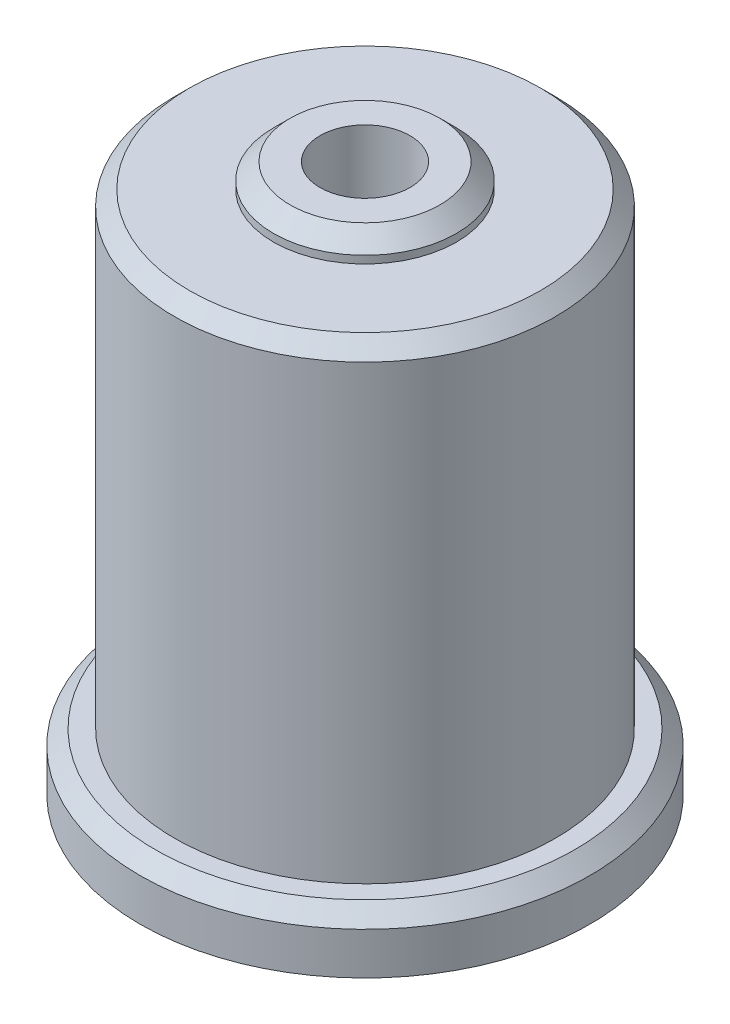
ISO-10303-21;
HEADER;
FILE_DESCRIPTION(('STEP AP214'),'2;1');
FILE_NAME('part.step','',(''),(''),'','','');
FILE_SCHEMA(('AUTOMOTIVE_DESIGN { 1 0 10303 214 1 1 1 1 }'));
ENDSEC;
DATA;
#1=APPLICATION_CONTEXT('core data for automotive mechanical design processes');
#2=APPLICATION_PROTOCOL_DEFINITION('international standard','automotive_design',2000,#1);
#3=PRODUCT_CONTEXT('',#1,'mechanical');
#4=PRODUCT('Part','Part','',(#3));
#5=PRODUCT_RELATED_PRODUCT_CATEGORY('part','',(#4));
#6=PRODUCT_DEFINITION_FORMATION('','',#4);
#7=PRODUCT_DEFINITION_CONTEXT('part definition',#1,'design');
#8=PRODUCT_DEFINITION('design','',#6,#7);
#9=PRODUCT_DEFINITION_SHAPE('','',#8);
#10=(LENGTH_UNIT() NAMED_UNIT(*) SI_UNIT(.MILLI.,.METRE.));
#11=(NAMED_UNIT(*) PLANE_ANGLE_UNIT() SI_UNIT($,.RADIAN.));
#12=(NAMED_UNIT(*) SI_UNIT($,.STERADIAN.) SOLID_ANGLE_UNIT());
#13=UNCERTAINTY_MEASURE_WITH_UNIT(LENGTH_MEASURE(1.E-05),#10,'distance_accuracy_value','');
#14=(GEOMETRIC_REPRESENTATION_CONTEXT(3) GLOBAL_UNCERTAINTY_ASSIGNED_CONTEXT((#13)) GLOBAL_UNIT_ASSIGNED_CONTEXT((#10,
#11,#12)) REPRESENTATION_CONTEXT('',''));
#15=CARTESIAN_POINT('',(0.,0.,0.));
#16=DIRECTION('',(0.,0.,1.));
#17=DIRECTION('',(1.,0.,0.));
#18=AXIS2_PLACEMENT_3D('',#15,#16,#17);
#19=CARTESIAN_POINT('',(0.,5.6843418860808E-11,0.));
#20=DIRECTION('',(0.,-1.,0.));
#21=DIRECTION('',(0.,0.,-1.));
#22=AXIS2_PLACEMENT_3D('',#19,#20,#21);
#23=CONICAL_SURFACE('',#22,3.15000000000509,0.785398163417049);
#24=CARTESIAN_POINT('',(0.,1.45,0.));
#25=DIRECTION('',(0.,-1.,0.));
#26=DIRECTION('',(0.,0.,-1.));
#27=AXIS2_PLACEMENT_3D('',#24,#25,#26);
#28=CIRCLE('',#27,1.7);
#29=CARTESIAN_POINT('',(0.,1.45,-1.7));
#30=VERTEX_POINT('',#29);
#31=EDGE_CURVE('E93',#30,#30,#28,.F.);
#32=ORIENTED_EDGE('',*,*,#31,.T.);
#33=EDGE_LOOP('',(#32));
#34=FACE_BOUND('',#33,.T.);
#35=CARTESIAN_POINT('',(0.,5.6843418860808E-11,0.));
#36=DIRECTION('',(0.,-1.,0.));
#37=DIRECTION('',(0.,0.,-1.));
#38=AXIS2_PLACEMENT_3D('',#35,#36,#37);
#39=CIRCLE('',#38,3.15000000000509);
#40=CARTESIAN_POINT('',(0.,5.6843418860808E-11,-3.15000000000509));
#41=VERTEX_POINT('',#40);
#42=EDGE_CURVE('E27',#41,#41,#39,.T.);
#43=ORIENTED_EDGE('',*,*,#42,.T.);
#44=EDGE_LOOP('',(#43));
#45=FACE_BOUND('',#44,.T.);
#46=ADVANCED_FACE('F24',(#34,#45),#23,.F.);
#47=CARTESIAN_POINT('',(0.,35.4250000004299,0.));
#48=DIRECTION('',(0.,-1.,0.));
#49=DIRECTION('',(0.,0.,-1.));
#50=AXIS2_PLACEMENT_3D('',#47,#48,#49);
#51=CONICAL_SURFACE('',#50,6.09999999949196,0.785398163397448);
#52=CARTESIAN_POINT('',(0.,36.5249999999264,0.));
#53=DIRECTION('',(0.,-1.,0.));
#54=DIRECTION('',(0.,0.,-1.));
#55=AXIS2_PLACEMENT_3D('',#52,#53,#54);
#56=CIRCLE('',#55,4.99999999999545);
#57=CARTESIAN_POINT('',(0.,36.5249999999264,-4.99999999999545));
#58=VERTEX_POINT('',#57);
#59=EDGE_CURVE('E62',#58,#58,#56,.F.);
#60=ORIENTED_EDGE('',*,*,#59,.F.);
#61=EDGE_LOOP('',(#60));
#62=FACE_BOUND('',#61,.T.);
#63=CARTESIAN_POINT('',(0.,35.4250000007,0.));
#64=DIRECTION('',(0.,-1.,0.));
#65=DIRECTION('',(0.,0.,-1.));
#66=AXIS2_PLACEMENT_3D('',#63,#64,#65);
#67=CIRCLE('',#66,6.1);
#68=CARTESIAN_POINT('',(0.,35.4250000007,-6.1));
#69=VERTEX_POINT('',#68);
#70=EDGE_CURVE('E63',#69,#69,#67,.T.);
#71=ORIENTED_EDGE('',*,*,#70,.F.);
#72=EDGE_LOOP('',(#71));
#73=FACE_BOUND('',#72,.T.);
#74=ADVANCED_FACE('F184',(#62,#73),#51,.T.);
#75=CARTESIAN_POINT('',(0.,0.,0.));
#76=DIRECTION('',(0.,-1.,0.));
#77=DIRECTION('',(0.,0.,-1.));
#78=AXIS2_PLACEMENT_3D('',#75,#76,#77);
#79=CYLINDRICAL_SURFACE('',#78,1.7);
#80=ORIENTED_EDGE('',*,*,#31,.F.);
#81=EDGE_LOOP('',(#80));
#82=FACE_BOUND('',#81,.T.);
#83=CARTESIAN_POINT('',(0.,1.7188811952451,0.));
#84=DIRECTION('',(0.,1.,0.));
#85=DIRECTION('',(0.,0.,1.));
#86=AXIS2_PLACEMENT_3D('',#83,#84,#85);
#87=CIRCLE('',#86,1.69999999997117);
#88=CARTESIAN_POINT('',(0.,1.71888119525931,-1.7000000000068));
#89=VERTEX_POINT('',#88);
#90=CARTESIAN_POINT('',(0.,1.71888119526405,1.7000000000068));
#91=VERTEX_POINT('',#90);
#92=EDGE_CURVE('E59',#89,#91,#87,.T.);
#93=ORIENTED_EDGE('',*,*,#92,.T.);
#94=CARTESIAN_POINT('',(0.,1.71888119530195,0.));
#95=DIRECTION('',(0.,1.,0.));
#96=DIRECTION('',(0.,0.,1.));
#97=AXIS2_PLACEMENT_3D('',#94,#95,#96);
#98=CIRCLE('',#97,1.70000000008486);
#99=EDGE_CURVE('E54',#91,#89,#98,.T.);
#100=ORIENTED_EDGE('',*,*,#99,.T.);
#101=EDGE_LOOP('',(#93,#100));
#102=FACE_BOUND('',#101,.T.);
#103=ADVANCED_FACE('F57',(#82,#102),#79,.F.);
#104=CARTESIAN_POINT('',(0.,0.,0.));
#105=DIRECTION('',(0.,1.,0.));
#106=DIRECTION('',(0.,0.,1.));
#107=AXIS2_PLACEMENT_3D('',#104,#105,#106);
#108=PLANE('',#107);
#109=ORIENTED_EDGE('',*,*,#42,.F.);
#110=EDGE_LOOP('',(#109));
#111=FACE_BOUND('',#110,.T.);
#112=CARTESIAN_POINT('',(0.,-5.21541143605475E-10,0.));
#113=DIRECTION('',(0.,-1.,0.));
#114=DIRECTION('',(0.,0.,-1.));
#115=AXIS2_PLACEMENT_3D('',#112,#113,#114);
#116=CIRCLE('',#115,15.);
#117=CARTESIAN_POINT('',(0.,-5.21541143605475E-10,-15.));
#118=VERTEX_POINT('',#117);
#119=EDGE_CURVE('E75',#118,#118,#116,.F.);
#120=ORIENTED_EDGE('',*,*,#119,.F.);
#121=EDGE_LOOP('',(#120));
#122=FACE_BOUND('',#121,.T.);
#123=ADVANCED_FACE('F178',(#111,#122),#108,.F.);
#124=CARTESIAN_POINT('',(0.,0.,0.));
#125=DIRECTION('',(0.,-1.,0.));
#126=DIRECTION('',(0.,0.,-1.));
#127=AXIS2_PLACEMENT_3D('',#124,#125,#126);
#128=CYLINDRICAL_SURFACE('',#127,6.1);
#129=CARTESIAN_POINT('',(0.,34.9250000007,0.));
#130=DIRECTION('',(0.,-1.,0.));
#131=DIRECTION('',(0.,0.,-1.));
#132=AXIS2_PLACEMENT_3D('',#129,#130,#131);
#133=CIRCLE('',#132,6.1);
#134=CARTESIAN_POINT('',(0.,34.9250000007,-6.1));
#135=VERTEX_POINT('',#134);
#136=EDGE_CURVE('E83',#135,#135,#133,.T.);
#137=ORIENTED_EDGE('',*,*,#136,.F.);
#138=EDGE_LOOP('',(#137));
#139=FACE_BOUND('',#138,.T.);
#140=ORIENTED_EDGE('',*,*,#70,.T.);
#141=EDGE_LOOP('',(#140));
#142=FACE_BOUND('',#141,.T.);
#143=ADVANCED_FACE('F175',(#139,#142),#128,.T.);
#144=CARTESIAN_POINT('',(0.,2.49999999994088,0.));
#145=DIRECTION('',(0.,1.,0.));
#146=DIRECTION('',(0.,0.,1.));
#147=AXIS2_PLACEMENT_3D('',#144,#145,#146);
#148=CONICAL_SURFACE('',#147,2.99999999987222,1.0297442586592);
#149=ORIENTED_EDGE('',*,*,#99,.F.);
#150=DIRECTION('',(0.,-0.515038074907186,-0.857167300703835));
#151=VECTOR('',#150,1.);
#152=CARTESIAN_POINT('',(0.,299830.146310623,499000.));
#153=LINE('',#152,#151);
#154=CARTESIAN_POINT('',(0.,2.49999999984619,2.99999999996805));
#155=VERTEX_POINT('',#154);
#156=EDGE_CURVE('E71',#91,#155,#153,.F.);
#157=ORIENTED_EDGE('',*,*,#156,.T.);
#158=CARTESIAN_POINT('',(0.,2.5,0.));
#159=DIRECTION('',(0.,1.,0.));
#160=DIRECTION('',(0.,0.,1.));
#161=AXIS2_PLACEMENT_3D('',#158,#159,#160);
#162=CIRCLE('',#161,3.);
#163=CARTESIAN_POINT('',(0.,2.49999999980022,-2.99999999996805));
#164=VERTEX_POINT('',#163);
#165=EDGE_CURVE('E46',#155,#164,#162,.T.);
#166=ORIENTED_EDGE('',*,*,#165,.T.);
#167=DIRECTION('',(0.,-0.515038074907186,0.857167300703835));
#168=VECTOR('',#167,1.);
#169=CARTESIAN_POINT('',(6.11098752774529E-11,299830.146310623,-499000.));
#170=LINE('',#169,#168);
#171=EDGE_CURVE('E65',#164,#89,#170,.T.);
#172=ORIENTED_EDGE('',*,*,#171,.T.);
#173=EDGE_LOOP('',(#149,#157,#166,#172));
#174=FACE_BOUND('',#173,.T.);
#175=ADVANCED_FACE('F66',(#174),#148,.F.);
#176=CARTESIAN_POINT('',(0.,36.525,-5.));
#177=DIRECTION('',(0.,1.,0.));
#178=DIRECTION('',(0.,0.,1.));
#179=AXIS2_PLACEMENT_3D('',#176,#177,#178);
#180=PLANE('',#179);
#181=CARTESIAN_POINT('',(0.,36.525,0.));
#182=DIRECTION('',(0.,1.,0.));
#183=DIRECTION('',(0.,0.,1.));
#184=AXIS2_PLACEMENT_3D('',#181,#182,#183);
#185=CIRCLE('',#184,3.);
#186=CARTESIAN_POINT('',(0.,36.525,3.));
#187=VERTEX_POINT('',#186);
#188=EDGE_CURVE('E205',#187,#187,#185,.F.);
#189=ORIENTED_EDGE('',*,*,#188,.T.);
#190=EDGE_LOOP('',(#189));
#191=FACE_BOUND('',#190,.T.);
#192=ORIENTED_EDGE('',*,*,#59,.T.);
#193=EDGE_LOOP('',(#192));
#194=FACE_BOUND('',#193,.T.);
#195=ADVANCED_FACE('F169',(#191,#194),#180,.T.);
#196=CARTESIAN_POINT('',(0.,2.49999999999773,0.));
#197=DIRECTION('',(0.,1.,0.));
#198=DIRECTION('',(0.,0.,1.));
#199=AXIS2_PLACEMENT_3D('',#196,#197,#198);
#200=CONICAL_SURFACE('',#199,2.9999999999859,1.02974425867217);
#201=ORIENTED_EDGE('',*,*,#171,.F.);
#202=CARTESIAN_POINT('',(0.,2.49999999963,0.));
#203=DIRECTION('',(0.,1.,0.));
#204=DIRECTION('',(0.,0.,1.));
#205=AXIS2_PLACEMENT_3D('',#202,#203,#204);
#206=CIRCLE('',#205,3.);
#207=EDGE_CURVE('E208',#164,#155,#206,.T.);
#208=ORIENTED_EDGE('',*,*,#207,.T.);
#209=ORIENTED_EDGE('',*,*,#156,.F.);
#210=ORIENTED_EDGE('',*,*,#92,.F.);
#211=EDGE_LOOP('',(#201,#208,#209,#210));
#212=FACE_BOUND('',#211,.T.);
#213=ADVANCED_FACE('F73',(#212),#200,.F.);
#214=CARTESIAN_POINT('',(0.,3.81,0.));
#215=DIRECTION('',(0.,-1.,0.));
#216=DIRECTION('',(0.,0.,-1.));
#217=AXIS2_PLACEMENT_3D('',#214,#215,#216);
#218=CYLINDRICAL_SURFACE('',#217,15.);
#219=ORIENTED_EDGE('',*,*,#119,.T.);
#220=EDGE_LOOP('',(#219));
#221=FACE_BOUND('',#220,.T.);
#222=CARTESIAN_POINT('',(0.,2.80999999999955,0.));
#223=DIRECTION('',(0.,-1.,0.));
#224=DIRECTION('',(0.,0.,-1.));
#225=AXIS2_PLACEMENT_3D('',#222,#223,#224);
#226=CIRCLE('',#225,14.9999999999996);
#227=CARTESIAN_POINT('',(0.,2.80999999999955,-14.9999999999996));
#228=VERTEX_POINT('',#227);
#229=EDGE_CURVE('E212',#228,#228,#226,.F.);
#230=ORIENTED_EDGE('',*,*,#229,.F.);
#231=EDGE_LOOP('',(#230));
#232=FACE_BOUND('',#231,.T.);
#233=ADVANCED_FACE('F162',(#221,#232),#218,.T.);
#234=CARTESIAN_POINT('',(0.,34.925,0.));
#235=DIRECTION('',(0.,1.,0.));
#236=DIRECTION('',(0.,0.,1.));
#237=AXIS2_PLACEMENT_3D('',#234,#235,#236);
#238=PLANE('',#237);
#239=ORIENTED_EDGE('',*,*,#136,.T.);
#240=EDGE_LOOP('',(#239));
#241=FACE_BOUND('',#240,.T.);
#242=CARTESIAN_POINT('',(0.,34.925,0.));
#243=DIRECTION('',(0.,-1.,0.));
#244=DIRECTION('',(0.,0.,-1.));
#245=AXIS2_PLACEMENT_3D('',#242,#243,#244);
#246=CIRCLE('',#245,11.7);
#247=CARTESIAN_POINT('',(0.,34.925,-11.7));
#248=VERTEX_POINT('',#247);
#249=EDGE_CURVE('E209',#248,#248,#246,.T.);
#250=ORIENTED_EDGE('',*,*,#249,.F.);
#251=EDGE_LOOP('',(#250));
#252=FACE_BOUND('',#251,.T.);
#253=ADVANCED_FACE('F156',(#241,#252),#238,.T.);
#254=CARTESIAN_POINT('',(0.,36.525,0.));
#255=DIRECTION('',(0.,1.,0.));
#256=DIRECTION('',(0.,0.,1.));
#257=AXIS2_PLACEMENT_3D('',#254,#255,#256);
#258=CYLINDRICAL_SURFACE('',#257,3.);
#259=ORIENTED_EDGE('',*,*,#188,.F.);
#260=EDGE_LOOP('',(#259));
#261=FACE_BOUND('',#260,.T.);
#262=CARTESIAN_POINT('',(1.64999999997305,28.,-2.50549396325899));
#263=CARTESIAN_POINT('',(1.64999840373645,27.9153708936246,-2.50549638400502));
#264=CARTESIAN_POINT('',(1.64345056127903,27.830729860844,-2.50984429312439));
#265=CARTESIAN_POINT('',(1.61766820329312,27.6641915008115,-2.52653380821258));
#266=CARTESIAN_POINT('',(1.5984215728503,27.5822968721654,-2.53888304741816));
#267=CARTESIAN_POINT('',(1.54839307975169,27.4239437560951,-2.56969382834051));
#268=CARTESIAN_POINT('',(1.51767952421363,27.3474562061838,-2.58811910143614));
#269=CARTESIAN_POINT('',(1.44580815787351,27.2007377586921,-2.62894336394147));
#270=CARTESIAN_POINT('',(1.40464700957062,27.1305088701559,-2.65134362247755));
#271=CARTESIAN_POINT('',(1.30819183349276,26.9905094475607,-2.70034130013384));
#272=CARTESIAN_POINT('',(1.25189044896349,26.9215011613221,-2.72713413750485));
#273=CARTESIAN_POINT('',(1.12882699874038,26.79328890541,-2.78033210845833));
#274=CARTESIAN_POINT('',(1.06205795707837,26.7340915285407,-2.80673697055438));
#275=CARTESIAN_POINT('',(0.912963549432726,26.6221708897394,-2.85889021724689));
#276=CARTESIAN_POINT('',(0.829793649593391,26.5704443324047,-2.88438619675471));
#277=CARTESIAN_POINT('',(0.654291228544041,26.482100467782,-2.92917486122191));
#278=CARTESIAN_POINT('',(0.561971033054588,26.445463168952,-2.94847574643836));
#279=CARTESIAN_POINT('',(0.391418922383002,26.3951864311231,-2.97532920501404));
#280=CARTESIAN_POINT('',(0.314389644420546,26.3783062858043,-2.98451058646589));
#281=CARTESIAN_POINT('',(0.15824316017263,26.3557148045967,-2.99684529996304));
#282=CARTESIAN_POINT('',(0.0791268427111652,26.3499987895632,-3.00000115743207));
#283=CARTESIAN_POINT('',(-0.0857394555554362,26.3500013115927,-2.99999874584159));
#284=CARTESIAN_POINT('',(-0.171491269053555,26.3567153517836,-2.99629076639798));
#285=CARTESIAN_POINT('',(-0.340348376484555,26.3832202031107,-2.98183771920608));
#286=CARTESIAN_POINT('',(-0.423452291679823,26.4030177137218,-2.9710890462504));
#287=CARTESIAN_POINT('',(-0.584397615441961,26.4546521590814,-2.94365850592254));
#288=CARTESIAN_POINT('',(-0.662257568957312,26.4864437222334,-2.92699901221874));
#289=CARTESIAN_POINT('',(-0.811396545708618,26.5608721508766,-2.88921483820871));
#290=CARTESIAN_POINT('',(-0.882674264516601,26.60351115979,-2.8680892755604));
#291=CARTESIAN_POINT('',(-1.02211397679699,26.7017135075675,-2.8215333458695));
#292=CARTESIAN_POINT('',(-1.08972586800159,26.7579633096431,-2.79590698364791));
#293=CARTESIAN_POINT('',(-1.2150825054972,26.8802876821038,-2.74375531569346));
#294=CARTESIAN_POINT('',(-1.27281736357077,26.9463719758152,-2.71722914058829));
#295=CARTESIAN_POINT('',(-1.38253830070289,27.0942501396172,-2.66320939989596));
#296=CARTESIAN_POINT('',(-1.43339190870582,27.1769511793746,-2.63587941810725));
#297=CARTESIAN_POINT('',(-1.52024089502079,27.3512970247828,-2.58676868519413));
#298=CARTESIAN_POINT('',(-1.55625793396413,27.4429285487803,-2.56497986218541));
#299=CARTESIAN_POINT('',(-1.60561843895256,27.6120858341263,-2.53429331170074));
#300=CARTESIAN_POINT('',(-1.62218822122814,27.6883498269149,-2.52362317859876));
#301=CARTESIAN_POINT('',(-1.64437513125999,27.8430737322073,-2.50922530445806));
#302=CARTESIAN_POINT('',(-1.65000148002315,27.9215317394188,-2.50549171875923));
#303=CARTESIAN_POINT('',(-1.64999840377452,28.0846291061707,-2.50549638401327));
#304=CARTESIAN_POINT('',(-1.64345056130775,28.1692701389479,-2.50984429311441));
#305=CARTESIAN_POINT('',(-1.61766820332933,28.3358084989774,-2.52653380818052));
#306=CARTESIAN_POINT('',(-1.59842157290324,28.4177031276239,-2.53888304738235));
#307=CARTESIAN_POINT('',(-1.54839307983107,28.5760562436965,-2.5696938282948));
#308=CARTESIAN_POINT('',(-1.51767952430278,28.6525437936098,-2.58811910138427));
#309=CARTESIAN_POINT('',(-1.44580815798417,28.7992622411064,-2.62894336387984));
#310=CARTESIAN_POINT('',(-1.40464700969308,28.8694911296457,-2.65134362241229));
#311=CARTESIAN_POINT('',(-1.30819183364077,29.0094905522472,-2.70034130006201));
#312=CARTESIAN_POINT('',(-1.25189044912548,29.0784988384894,-2.72713413743019));
#313=CARTESIAN_POINT('',(-1.12882699893082,29.2067110944113,-2.78033210838064));
#314=CARTESIAN_POINT('',(-1.06205795728323,29.2659084712869,-2.8067369704765));
#315=CARTESIAN_POINT('',(-0.91296354966216,29.3778291101085,-2.85889021717338));
#316=CARTESIAN_POINT('',(-0.829793649832179,29.4295556674566,-2.88438619668581));
#317=CARTESIAN_POINT('',(-0.654291228799361,29.5178995321079,-2.92917486116468));
#318=CARTESIAN_POINT('',(-0.56197103331708,29.5545368309531,-2.94847574638821));
#319=CARTESIAN_POINT('',(-0.391418922610912,29.6048135688235,-2.97532920498511));
#320=CARTESIAN_POINT('',(-0.31438964460507,29.6216937141622,-2.98451058644766));
#321=CARTESIAN_POINT('',(-0.158243160266696,29.6442851953965,-2.99684529995926));
#322=CARTESIAN_POINT('',(-0.0791268427581616,29.6500012104367,-3.00000115743206));
#323=CARTESIAN_POINT('',(0.0857394555555356,29.6499986884073,-2.9999987458416));
#324=CARTESIAN_POINT('',(0.171491269053654,29.6432846482164,-2.99629076639798));
#325=CARTESIAN_POINT('',(0.340348376484621,29.6167797968893,-2.98183771920607));
#326=CARTESIAN_POINT('',(0.423452291679859,29.5969822862782,-2.97108904625039));
#327=CARTESIAN_POINT('',(0.584397615442018,29.5453478409186,-2.94365850592253));
#328=CARTESIAN_POINT('',(0.662257568957415,29.5135562777665,-2.92699901221872));
#329=CARTESIAN_POINT('',(0.811396545708705,29.4391278491234,-2.88921483820868));
#330=CARTESIAN_POINT('',(0.882674264516634,29.3964888402099,-2.86808927556038));
#331=CARTESIAN_POINT('',(1.02211397679687,29.2982864924326,-2.82153334586955));
#332=CARTESIAN_POINT('',(1.08972586800139,29.2420366903571,-2.79590698364803));
#333=CARTESIAN_POINT('',(1.21508250549695,29.1197123178964,-2.74375531569353));
#334=CARTESIAN_POINT('',(1.2728173635705,29.0536280241849,-2.71722914058824));
#335=CARTESIAN_POINT('',(1.38253830070326,28.9057498603826,-2.66320939989597));
#336=CARTESIAN_POINT('',(1.43339190870686,28.8230488206249,-2.63587941810747));
#337=CARTESIAN_POINT('',(1.5202408950203,28.6487029752166,-2.5867686851936));
#338=CARTESIAN_POINT('',(1.55625793396153,28.5570714512194,-2.5649798621839));
#339=CARTESIAN_POINT('',(1.6056184389637,28.3879141658428,-2.53429331169626));
#340=CARTESIAN_POINT('',(1.62218822124904,28.3116501730215,-2.52362317859368));
#341=CARTESIAN_POINT('',(1.64437513126703,28.1569262676616,-2.50922530444502));
#342=CARTESIAN_POINT('',(1.65000148000652,28.0784682604151,-2.5054917187389));
#343=CARTESIAN_POINT('',(1.64999999997305,28.,-2.50549396325899));
#344=B_SPLINE_CURVE_WITH_KNOTS('',3,(#262,#263,#264,#265,#266,#267,#268,#269,#270,#271,#272,
#273,#274,#275,#276,#277,#278,#279,#280,#281,#282,#283,#284,#285,#286,#287,#288,#289,#290,#291,
#292,#293,#294,#295,#296,#297,#298,#299,#300,#301,#302,#303,#304,#305,#306,#307,#308,#309,#310,
#311,#312,#313,#314,#315,#316,#317,#318,#319,#320,#321,#322,#323,#324,#325,#326,#327,#328,#329,
#330,#331,#332,#333,#334,#335,#336,#337,#338,#339,#340,#341,#342,#343),.UNSPECIFIED.,.T.,.F.,(4,
2,2,2,2,2,2,2,2,2,2,2,2,2,2,2,2,2,2,2,2,2,2,2,2,2,2,2,2,2,2,2,2,2,2,2,2,2,2,2,4),(0.,
0.253564174119336,0.507370604324656,0.759688655532,1.01208741182752,1.2899706705777,
1.56803991271795,1.87005826832733,2.17167518686959,2.40886924606036,2.64596387039496,
2.90287244034478,3.15991266401271,3.41599013933279,3.67211825413985,3.94583529023378,
4.21982476976385,4.52089904055118,4.82153218701419,5.05683570180663,5.29194086231763,
5.54550503642476,5.79931146662029,6.05162951781719,6.30402827410063,6.58191153283098,
6.85998077495234,7.16199913056275,7.46361604910634,7.70081010843803,7.93790473291329,
8.19481330286323,8.45185352653104,8.70793100185129,8.96405911665818,9.23777615275161,
9.51176563228218,9.81283990307045,10.1134730495325,10.3487765644231,10.583881725034),.UNSPECIFIED.);
#345=CARTESIAN_POINT('',(1.64999999997305,28.,-2.50549396325899));
#346=VERTEX_POINT('',#345);
#347=EDGE_CURVE('E141',#346,#346,#344,.T.);
#348=ORIENTED_EDGE('',*,*,#347,.T.);
#349=EDGE_LOOP('',(#348));
#350=FACE_BOUND('',#349,.T.);
#351=CARTESIAN_POINT('',(1.64999999997305,12.,-2.50549396325899));
#352=CARTESIAN_POINT('',(1.64999840373645,11.9153708936246,-2.50549638400502));
#353=CARTESIAN_POINT('',(1.64345056127903,11.830729860844,-2.50984429312439));
#354=CARTESIAN_POINT('',(1.61766820329312,11.6641915008115,-2.52653380821258));
#355=CARTESIAN_POINT('',(1.5984215728503,11.5822968721653,-2.53888304741816));
#356=CARTESIAN_POINT('',(1.54839307975169,11.4239437560951,-2.56969382834051));
#357=CARTESIAN_POINT('',(1.51767952421363,11.3474562061838,-2.58811910143614));
#358=CARTESIAN_POINT('',(1.44580815787351,11.2007377586921,-2.62894336394147));
#359=CARTESIAN_POINT('',(1.40464700957063,11.1305088701559,-2.65134362247755));
#360=CARTESIAN_POINT('',(1.30819183349276,10.9905094475607,-2.70034130013384));
#361=CARTESIAN_POINT('',(1.25189044896349,10.9215011613221,-2.72713413750485));
#362=CARTESIAN_POINT('',(1.12882699874038,10.79328890541,-2.78033210845833));
#363=CARTESIAN_POINT('',(1.06205795707837,10.7340915285407,-2.80673697055438));
#364=CARTESIAN_POINT('',(0.912963549432728,10.6221708897394,-2.85889021724689));
#365=CARTESIAN_POINT('',(0.829793649593392,10.5704443324047,-2.88438619675471));
#366=CARTESIAN_POINT('',(0.654291228544041,10.482100467782,-2.92917486122191));
#367=CARTESIAN_POINT('',(0.561971033054588,10.445463168952,-2.94847574643836));
#368=CARTESIAN_POINT('',(0.391418922383001,10.3951864311231,-2.97532920501404));
#369=CARTESIAN_POINT('',(0.314389644420545,10.3783062858043,-2.98451058646589));
#370=CARTESIAN_POINT('',(0.158243160172628,10.3557148045967,-2.99684529996304));
#371=CARTESIAN_POINT('',(0.0791268427111628,10.3499987895632,-3.00000115743207));
#372=CARTESIAN_POINT('',(-0.0857394555554389,10.3500013115927,-2.99999874584159));
#373=CARTESIAN_POINT('',(-0.171491269053557,10.3567153517836,-2.99629076639798));
#374=CARTESIAN_POINT('',(-0.340348376484558,10.3832202031107,-2.98183771920608));
#375=CARTESIAN_POINT('',(-0.423452291679826,10.4030177137218,-2.9710890462504));
#376=CARTESIAN_POINT('',(-0.584397615441964,10.4546521590814,-2.94365850592254));
#377=CARTESIAN_POINT('',(-0.662257568957314,10.4864437222334,-2.92699901221874));
#378=CARTESIAN_POINT('',(-0.811396545708621,10.5608721508766,-2.88921483820871));
#379=CARTESIAN_POINT('',(-0.882674264516605,10.60351115979,-2.8680892755604));
#380=CARTESIAN_POINT('',(-1.02211397679699,10.7017135075675,-2.8215333458695));
#381=CARTESIAN_POINT('',(-1.08972586800159,10.7579633096431,-2.79590698364791));
#382=CARTESIAN_POINT('',(-1.2150825054972,10.8802876821038,-2.74375531569346));
#383=CARTESIAN_POINT('',(-1.27281736357077,10.9463719758152,-2.71722914058829));
#384=CARTESIAN_POINT('',(-1.38253830070289,11.0942501396172,-2.66320939989596));
#385=CARTESIAN_POINT('',(-1.43339190870582,11.1769511793746,-2.63587941810725));
#386=CARTESIAN_POINT('',(-1.5202408950208,11.3512970247829,-2.58676868519412));
#387=CARTESIAN_POINT('',(-1.55625793396413,11.4429285487803,-2.56497986218541));
#388=CARTESIAN_POINT('',(-1.60561843895256,11.6120858341263,-2.53429331170074));
#389=CARTESIAN_POINT('',(-1.62218822122814,11.6883498269149,-2.52362317859876));
#390=CARTESIAN_POINT('',(-1.64437513125999,11.8430737322073,-2.50922530445806));
#391=CARTESIAN_POINT('',(-1.65000148002315,11.9215317394188,-2.50549171875923));
#392=CARTESIAN_POINT('',(-1.64999840377452,12.0846291061707,-2.50549638401327));
#393=CARTESIAN_POINT('',(-1.64345056130775,12.1692701389479,-2.50984429311441));
#394=CARTESIAN_POINT('',(-1.61766820332933,12.3358084989774,-2.52653380818052));
#395=CARTESIAN_POINT('',(-1.59842157290324,12.4177031276239,-2.53888304738235));
#396=CARTESIAN_POINT('',(-1.54839307983107,12.5760562436965,-2.5696938282948));
#397=CARTESIAN_POINT('',(-1.51767952430278,12.6525437936098,-2.58811910138427));
#398=CARTESIAN_POINT('',(-1.44580815798417,12.7992622411064,-2.62894336387984));
#399=CARTESIAN_POINT('',(-1.40464700969308,12.8694911296457,-2.65134362241229));
#400=CARTESIAN_POINT('',(-1.30819183364076,13.0094905522472,-2.70034130006201));
#401=CARTESIAN_POINT('',(-1.25189044912548,13.0784988384894,-2.72713413743019));
#402=CARTESIAN_POINT('',(-1.12882699893082,13.2067110944113,-2.78033210838065));
#403=CARTESIAN_POINT('',(-1.06205795728323,13.2659084712869,-2.8067369704765));
#404=CARTESIAN_POINT('',(-0.912963549662157,13.3778291101085,-2.85889021717339));
#405=CARTESIAN_POINT('',(-0.829793649832175,13.4295556674566,-2.88438619668581));
#406=CARTESIAN_POINT('',(-0.654291228799356,13.5178995321079,-2.92917486116468));
#407=CARTESIAN_POINT('',(-0.561971033317075,13.5545368309531,-2.94847574638821));
#408=CARTESIAN_POINT('',(-0.391418922610906,13.6048135688235,-2.97532920498511));
#409=CARTESIAN_POINT('',(-0.314389644605065,13.6216937141622,-2.98451058644766));
#410=CARTESIAN_POINT('',(-0.158243160266693,13.6442851953965,-2.99684529995926));
#411=CARTESIAN_POINT('',(-0.0791268427581598,13.6500012104368,-3.00000115743206));
#412=CARTESIAN_POINT('',(0.0857394555555361,13.6499986884073,-2.9999987458416));
#413=CARTESIAN_POINT('',(0.171491269053654,13.6432846482164,-2.99629076639798));
#414=CARTESIAN_POINT('',(0.340348376484621,13.6167797968893,-2.98183771920607));
#415=CARTESIAN_POINT('',(0.423452291679859,13.5969822862782,-2.97108904625039));
#416=CARTESIAN_POINT('',(0.584397615442017,13.5453478409186,-2.94365850592253));
#417=CARTESIAN_POINT('',(0.662257568957413,13.5135562777665,-2.92699901221872));
#418=CARTESIAN_POINT('',(0.811396545708705,13.4391278491234,-2.88921483820868));
#419=CARTESIAN_POINT('',(0.882674264516634,13.3964888402099,-2.86808927556038));
#420=CARTESIAN_POINT('',(1.02211397679687,13.2982864924326,-2.82153334586955));
#421=CARTESIAN_POINT('',(1.08972586800139,13.2420366903571,-2.79590698364803));
#422=CARTESIAN_POINT('',(1.21508250549695,13.1197123178964,-2.74375531569353));
#423=CARTESIAN_POINT('',(1.2728173635705,13.0536280241849,-2.71722914058824));
#424=CARTESIAN_POINT('',(1.38253830070326,12.9057498603826,-2.66320939989597));
#425=CARTESIAN_POINT('',(1.43339190870686,12.8230488206249,-2.63587941810746));
#426=CARTESIAN_POINT('',(1.5202408950203,12.6487029752166,-2.5867686851936));
#427=CARTESIAN_POINT('',(1.55625793396153,12.5570714512194,-2.5649798621839));
#428=CARTESIAN_POINT('',(1.6056184389637,12.3879141658428,-2.53429331169625));
#429=CARTESIAN_POINT('',(1.62218822124904,12.3116501730215,-2.52362317859368));
#430=CARTESIAN_POINT('',(1.64437513126703,12.1569262676616,-2.50922530444502));
#431=CARTESIAN_POINT('',(1.65000148000652,12.0784682604151,-2.50549171873889));
#432=CARTESIAN_POINT('',(1.64999999997305,12.,-2.50549396325899));
#433=B_SPLINE_CURVE_WITH_KNOTS('',3,(#351,#352,#353,#354,#355,#356,#357,#358,#359,#360,#361,
#362,#363,#364,#365,#366,#367,#368,#369,#370,#371,#372,#373,#374,#375,#376,#377,#378,#379,#380,
#381,#382,#383,#384,#385,#386,#387,#388,#389,#390,#391,#392,#393,#394,#395,#396,#397,#398,#399,
#400,#401,#402,#403,#404,#405,#406,#407,#408,#409,#410,#411,#412,#413,#414,#415,#416,#417,#418,
#419,#420,#421,#422,#423,#424,#425,#426,#427,#428,#429,#430,#431,#432),.UNSPECIFIED.,.T.,.F.,(4,
2,2,2,2,2,2,2,2,2,2,2,2,2,2,2,2,2,2,2,2,2,2,2,2,2,2,2,2,2,2,2,2,2,2,2,2,2,2,2,4),(0.,
0.253564174119334,0.507370604324655,0.759688655531995,1.01208741182752,1.2899706705777,
1.56803991271795,1.87005826832733,2.17167518686959,2.40886924606036,2.64596387039496,
2.90287244034478,3.15991266401271,3.41599013933279,3.67211825413985,3.94583529023378,
4.21982476976385,4.52089904055119,4.8215321870142,5.05683570180663,5.29194086231763,
5.54550503642476,5.79931146662029,6.0516295178172,6.30402827410064,6.58191153283098,
6.85998077495234,7.16199913056275,7.46361604910634,7.70081010843803,7.93790473291329,
8.19481330286323,8.45185352653104,8.70793100185128,8.96405911665818,9.2377761527516,
9.51176563228218,9.81283990307045,10.1134730495325,10.3487765644231,10.583881725034),.UNSPECIFIED.);
#434=CARTESIAN_POINT('',(1.64999999997305,12.,-2.50549396325899));
#435=VERTEX_POINT('',#434);
#436=EDGE_CURVE('E133',#435,#435,#433,.T.);
#437=ORIENTED_EDGE('',*,*,#436,.T.);
#438=EDGE_LOOP('',(#437));
#439=FACE_BOUND('',#438,.T.);
#440=ORIENTED_EDGE('',*,*,#207,.F.);
#441=ORIENTED_EDGE('',*,*,#165,.F.);
#442=EDGE_LOOP('',(#440,#441));
#443=FACE_BOUND('',#442,.T.);
#444=ADVANCED_FACE('F150',(#261,#350,#439,#443),#258,.F.);
#445=CARTESIAN_POINT('',(0.,2.80999999999955,0.));
#446=DIRECTION('',(0.,-1.,0.));
#447=DIRECTION('',(0.,0.,-1.));
#448=AXIS2_PLACEMENT_3D('',#445,#446,#447);
#449=CONICAL_SURFACE('',#448,14.9999999999996,0.785398163397);
#450=ORIENTED_EDGE('',*,*,#229,.T.);
#451=EDGE_LOOP('',(#450));
#452=FACE_BOUND('',#451,.T.);
#453=CARTESIAN_POINT('',(0.,3.81,0.));
#454=DIRECTION('',(0.,-1.,0.));
#455=DIRECTION('',(0.,0.,-1.));
#456=AXIS2_PLACEMENT_3D('',#453,#454,#455);
#457=CIRCLE('',#456,14.);
#458=CARTESIAN_POINT('',(0.,3.81,-14.));
#459=VERTEX_POINT('',#458);
#460=EDGE_CURVE('E130',#459,#459,#457,.F.);
#461=ORIENTED_EDGE('',*,*,#460,.F.);
#462=EDGE_LOOP('',(#461));
#463=FACE_BOUND('',#462,.T.);
#464=ADVANCED_FACE('F155',(#452,#463),#449,.T.);
#465=CARTESIAN_POINT('',(0.,33.9249999999995,0.));
#466=DIRECTION('',(0.,-1.,0.));
#467=DIRECTION('',(0.,0.,-1.));
#468=AXIS2_PLACEMENT_3D('',#465,#466,#467);
#469=CONICAL_SURFACE('',#468,12.6999999999995,0.785398163397);
#470=ORIENTED_EDGE('',*,*,#249,.T.);
#471=EDGE_LOOP('',(#470));
#472=FACE_BOUND('',#471,.T.);
#473=CARTESIAN_POINT('',(0.,33.925,0.));
#474=DIRECTION('',(0.,-1.,0.));
#475=DIRECTION('',(0.,0.,-1.));
#476=AXIS2_PLACEMENT_3D('',#473,#474,#475);
#477=CIRCLE('',#476,12.7);
#478=CARTESIAN_POINT('',(0.,33.925,-12.7));
#479=VERTEX_POINT('',#478);
#480=EDGE_CURVE('E132',#479,#479,#477,.T.);
#481=ORIENTED_EDGE('',*,*,#480,.F.);
#482=EDGE_LOOP('',(#481));
#483=FACE_BOUND('',#482,.T.);
#484=ADVANCED_FACE('F266',(#472,#483),#469,.T.);
#485=CARTESIAN_POINT('',(0.,28.,0.));
#486=DIRECTION('',(0.,0.,1.));
#487=DIRECTION('',(1.,0.,0.));
#488=AXIS2_PLACEMENT_3D('',#485,#486,#487);
#489=CYLINDRICAL_SURFACE('',#488,1.65);
#490=ORIENTED_EDGE('',*,*,#347,.F.);
#491=EDGE_LOOP('',(#490));
#492=FACE_BOUND('',#491,.T.);
#493=CARTESIAN_POINT('',(0.,29.65,-12.7));
#494=CARTESIAN_POINT('',(-0.0922613706016228,29.6499960266368,-12.6999986483359));
#495=CARTESIAN_POINT('',(-0.18458171296936,29.6422353589815,-12.698983991526));
#496=CARTESIAN_POINT('',(-0.366653818962641,29.6113994418027,-12.6950337968835));
#497=CARTESIAN_POINT('',(-0.456402728949492,29.5883078169848,-12.6920962051737));
#498=CARTESIAN_POINT('',(-0.630667643384155,29.5275031550844,-12.6846308888954));
#499=CARTESIAN_POINT('',(-0.715187195161164,29.4898001585595,-12.6801042564754));
#500=CARTESIAN_POINT('',(-0.876680404764714,29.4008671595393,-12.6699639395096));
#501=CARTESIAN_POINT('',(-0.953655618333536,29.3496399539966,-12.6643504797955));
#502=CARTESIAN_POINT('',(-1.09834448754996,29.2347934063494,-12.6526259549517));
#503=CARTESIAN_POINT('',(-1.16600785478158,29.1711109550385,-12.6465124520145));
#504=CARTESIAN_POINT('',(-1.28973411953138,29.0332781566404,-12.6344948729124));
#505=CARTESIAN_POINT('',(-1.34579386345574,28.9591249730398,-12.6285908540406));
#506=CARTESIAN_POINT('',(-1.44491493186581,28.8021088518647,-12.61763548826));
#507=CARTESIAN_POINT('',(-1.48792229372564,28.7192116153581,-12.6125877182579));
#508=CARTESIAN_POINT('',(-1.55934132232045,28.5473524320158,-12.6039581295904));
#509=CARTESIAN_POINT('',(-1.58776927485075,28.4583973784371,-12.6003746761374));
#510=CARTESIAN_POINT('',(-1.62228028697603,28.307466304609,-12.5959671608161));
#511=CARTESIAN_POINT('',(-1.63266037545089,28.2464533709182,-12.5946206585225));
#512=CARTESIAN_POINT('',(-1.64652153728124,28.1236357848426,-12.5928160112748));
#513=CARTESIAN_POINT('',(-1.65000266511254,28.0618311387133,-12.5923578593062));
#514=CARTESIAN_POINT('',(-1.64999602341033,27.9077423322541,-12.5923601889618));
#515=CARTESIAN_POINT('',(-1.64223595773393,27.8154256831494,-12.5933836646408));
#516=CARTESIAN_POINT('',(-1.61140264942754,27.6333612522402,-12.597365349171));
#517=CARTESIAN_POINT('',(-1.58831301888256,27.543616326933,-12.6003256284931));
#518=CARTESIAN_POINT('',(-1.52751418964121,27.3693598394773,-12.6078401281504));
#519=CARTESIAN_POINT('',(-1.48981512575568,27.2848446963717,-12.612393243296));
#520=CARTESIAN_POINT('',(-1.4008913903022,27.1233588852263,-12.6225788360358));
#521=CARTESIAN_POINT('',(-1.34966950620143,27.0463866668373,-12.6282110911207));
#522=CARTESIAN_POINT('',(-1.23482835305465,26.9016944622995,-12.6399580315527));
#523=CARTESIAN_POINT('',(-1.17114478450976,26.8340257024641,-12.6460751167178));
#524=CARTESIAN_POINT('',(-1.03330748177513,26.7102890152266,-12.6580824507853));
#525=CARTESIAN_POINT('',(-0.959150925293784,26.6542242249704,-12.6639726379962));
#526=CARTESIAN_POINT('',(-0.802131812823001,26.5550978506845,-12.6748884883045));
#527=CARTESIAN_POINT('',(-0.719235538826971,26.512089310033,-12.6799105900136));
#528=CARTESIAN_POINT('',(-0.547378437680784,26.4406678269497,-12.6884888294279));
#529=CARTESIAN_POINT('',(-0.458424495836813,26.4122386168661,-12.6920466001579));
#530=CARTESIAN_POINT('',(-0.307490063388874,26.3777240200307,-12.6964208871056));
#531=CARTESIAN_POINT('',(-0.246472366923985,26.3673423086062,-12.6977566275013));
#532=CARTESIAN_POINT('',(-0.123645272995091,26.353478993515,-12.6995466335294));
#533=CARTESIAN_POINT('',(-0.061835881603872,26.3499973369525,-12.7000009059191));
#534=CARTESIAN_POINT('',(0.0922613706015583,26.3500039733632,-12.6999986483359));
#535=CARTESIAN_POINT('',(0.184581712969279,26.3577646410185,-12.698983991526));
#536=CARTESIAN_POINT('',(0.366653818962576,26.3886005581973,-12.6950337968835));
#537=CARTESIAN_POINT('',(0.456402728949457,26.4116921830152,-12.6920962051737));
#538=CARTESIAN_POINT('',(0.630667643384159,26.4724968449156,-12.6846308888954));
#539=CARTESIAN_POINT('',(0.715187195161177,26.5101998414405,-12.6801042564754));
#540=CARTESIAN_POINT('',(0.876680404764727,26.5991328404607,-12.6699639395096));
#541=CARTESIAN_POINT('',(0.95365561833354,26.6503600460034,-12.6643504797955));
#542=CARTESIAN_POINT('',(1.09834448754994,26.7652065936506,-12.6526259549517));
#543=CARTESIAN_POINT('',(1.16600785478156,26.8288890449615,-12.6465124520145));
#544=CARTESIAN_POINT('',(1.28973411953136,26.9667218433595,-12.6344948729124));
#545=CARTESIAN_POINT('',(1.34579386345573,27.0408750269602,-12.6285908540406));
#546=CARTESIAN_POINT('',(1.44491493186583,27.1978911481353,-12.61763548826));
#547=CARTESIAN_POINT('',(1.48792229372568,27.280788384642,-12.6125877182579));
#548=CARTESIAN_POINT('',(1.55934132232048,27.4526475679843,-12.6039581295904));
#549=CARTESIAN_POINT('',(1.58776927485076,27.5416026215629,-12.6003746761374));
#550=CARTESIAN_POINT('',(1.62228028697108,27.6925336953693,-12.5959671608167));
#551=CARTESIAN_POINT('',(1.63266037544343,27.7535466290379,-12.5946206585234));
#552=CARTESIAN_POINT('',(1.64652153727375,27.8763642150688,-12.5928160112758));
#553=CARTESIAN_POINT('',(1.65000266510755,27.9381688611756,-12.5923578593068));
#554=CARTESIAN_POINT('',(1.64999602341778,28.0922576676124,-12.5923601889608));
#555=CARTESIAN_POINT('',(1.64223595774887,28.1845743167175,-12.5933836646388));
#556=CARTESIAN_POINT('',(1.61140264945729,28.366638747629,-12.5973653491671));
#557=CARTESIAN_POINT('',(1.58831301891962,28.456383672938,-12.6003256284884));
#558=CARTESIAN_POINT('',(1.52751418969248,28.6306401603985,-12.6078401281442));
#559=CARTESIAN_POINT('',(1.48981512581387,28.7151553035071,-12.6123932432891));
#560=CARTESIAN_POINT('',(1.40089139037364,28.8766411146595,-12.6225788360278));
#561=CARTESIAN_POINT('',(1.34966950627922,28.9536133330526,-12.6282110911123));
#562=CARTESIAN_POINT('',(1.23482835314441,29.0983055375996,-12.6399580315439));
#563=CARTESIAN_POINT('',(1.17114478460517,29.16597429744,-12.646075116709));
#564=CARTESIAN_POINT('',(1.03330748188094,29.2897109846886,-12.6580824507766));
#565=CARTESIAN_POINT('',(0.959150925404357,29.3457757749507,-12.6639726379878));
#566=CARTESIAN_POINT('',(0.802131812941923,29.4449021492495,-12.6748884882969));
#567=CARTESIAN_POINT('',(0.71923553894946,29.4879106899078,-12.6799105900066));
#568=CARTESIAN_POINT('',(0.547378437809168,29.5593321730052,-12.6884888294224));
#569=CARTESIAN_POINT('',(0.458424495967519,29.5877613830961,-12.6920466001531));
#570=CARTESIAN_POINT('',(0.30749006350031,29.622275979949,-12.696420887103));
#571=CARTESIAN_POINT('',(0.246472367013655,29.6326576913811,-12.6977566274996));
#572=CARTESIAN_POINT('',(0.123645273040359,29.6465210064825,-12.6995466335291));
#573=CARTESIAN_POINT('',(0.0618358816265041,29.6500026630475,-12.7000009059191));
#574=CARTESIAN_POINT('',(0.,29.65,-12.7));
#575=B_SPLINE_CURVE_WITH_KNOTS('',3,(#493,#494,#495,#496,#497,#498,#499,#500,#501,#502,#503,
#504,#505,#506,#507,#508,#509,#510,#511,#512,#513,#514,#515,#516,#517,#518,#519,#520,#521,#522,
#523,#524,#525,#526,#527,#528,#529,#530,#531,#532,#533,#534,#535,#536,#537,#538,#539,#540,#541,
#542,#543,#544,#545,#546,#547,#548,#549,#550,#551,#552,#553,#554,#555,#556,#557,#558,#559,#560,
#561,#562,#563,#564,#565,#566,#567,#568,#569,#570,#571,#572,#573,#574),.UNSPECIFIED.,.T.,.F.,(4,
2,2,2,2,2,2,2,2,2,2,2,2,2,2,2,2,2,2,2,2,2,2,2,2,2,2,2,2,2,2,2,2,2,2,2,2,2,2,2,4),(0.,
0.27655798176795,0.553411836773096,0.830075781331917,1.1066825535578,1.38472897037035,
1.66285085477184,1.9421073913385,2.22105130377737,2.4063946191166,2.59173647093544,
2.86828332645776,3.14512629864268,3.42177756298099,3.69837184548996,3.97643282857886,
4.25456888785072,4.53382025192015,4.81275934497318,4.99811685272513,5.18347293952179,
5.46003092128963,5.73688477629488,6.01354872085373,6.29015549307959,6.56820190989211,
6.84632379429362,7.12558033086039,7.40452424329916,7.58986755857183,7.77520941032411,
8.05175626584592,8.32859923803052,8.60525050236842,8.88184478487697,9.15990576796539,
9.43804182723672,9.71729319130614,9.99623228435938,10.1815897921791,10.3669458790436),.UNSPECIFIED.);
#576=CARTESIAN_POINT('',(0.,29.65,-12.7));
#577=VERTEX_POINT('',#576);
#578=EDGE_CURVE('E104',#577,#577,#575,.T.);
#579=ORIENTED_EDGE('',*,*,#578,.F.);
#580=EDGE_LOOP('',(#579));
#581=FACE_BOUND('',#580,.T.);
#582=ADVANCED_FACE('F124',(#492,#581),#489,.F.);
#583=CARTESIAN_POINT('',(0.,12.,0.));
#584=DIRECTION('',(0.,0.,1.));
#585=DIRECTION('',(1.,0.,0.));
#586=AXIS2_PLACEMENT_3D('',#583,#584,#585);
#587=CYLINDRICAL_SURFACE('',#586,1.65);
#588=ORIENTED_EDGE('',*,*,#436,.F.);
#589=EDGE_LOOP('',(#588));
#590=FACE_BOUND('',#589,.T.);
#591=CARTESIAN_POINT('',(0.,13.65,-12.7));
#592=CARTESIAN_POINT('',(-0.0922613706016227,13.6499960266368,-12.6999986483359));
#593=CARTESIAN_POINT('',(-0.18458171296936,13.6422353589815,-12.698983991526));
#594=CARTESIAN_POINT('',(-0.366653818962641,13.6113994418027,-12.6950337968835));
#595=CARTESIAN_POINT('',(-0.456402728949491,13.5883078169848,-12.6920962051737));
#596=CARTESIAN_POINT('',(-0.630667643384155,13.5275031550844,-12.6846308888954));
#597=CARTESIAN_POINT('',(-0.715187195161164,13.4898001585595,-12.6801042564754));
#598=CARTESIAN_POINT('',(-0.876680404764715,13.4008671595393,-12.6699639395096));
#599=CARTESIAN_POINT('',(-0.953655618333536,13.3496399539966,-12.6643504797955));
#600=CARTESIAN_POINT('',(-1.09834448754996,13.2347934063494,-12.6526259549517));
#601=CARTESIAN_POINT('',(-1.16600785478158,13.1711109550385,-12.6465124520145));
#602=CARTESIAN_POINT('',(-1.28973411953138,13.0332781566404,-12.6344948729124));
#603=CARTESIAN_POINT('',(-1.34579386345574,12.9591249730398,-12.6285908540406));
#604=CARTESIAN_POINT('',(-1.44491493186581,12.8021088518647,-12.61763548826));
#605=CARTESIAN_POINT('',(-1.48792229372565,12.7192116153581,-12.6125877182579));
#606=CARTESIAN_POINT('',(-1.55934132232045,12.5473524320158,-12.6039581295904));
#607=CARTESIAN_POINT('',(-1.58776927485075,12.4583973784371,-12.6003746761374));
#608=CARTESIAN_POINT('',(-1.62228028697603,12.307466304609,-12.5959671608161));
#609=CARTESIAN_POINT('',(-1.63266037545089,12.2464533709182,-12.5946206585225));
#610=CARTESIAN_POINT('',(-1.64652153728124,12.1236357848426,-12.5928160112748));
#611=CARTESIAN_POINT('',(-1.65000266511254,12.0618311387133,-12.5923578593062));
#612=CARTESIAN_POINT('',(-1.64999602341033,11.9077423322541,-12.5923601889618));
#613=CARTESIAN_POINT('',(-1.64223595773393,11.8154256831494,-12.5933836646408));
#614=CARTESIAN_POINT('',(-1.61140264942754,11.6333612522402,-12.597365349171));
#615=CARTESIAN_POINT('',(-1.58831301888256,11.543616326933,-12.6003256284931));
#616=CARTESIAN_POINT('',(-1.5275141896412,11.3693598394773,-12.6078401281504));
#617=CARTESIAN_POINT('',(-1.48981512575568,11.2848446963717,-12.612393243296));
#618=CARTESIAN_POINT('',(-1.40089139030219,11.1233588852263,-12.6225788360358));
#619=CARTESIAN_POINT('',(-1.34966950620143,11.0463866668373,-12.6282110911207));
#620=CARTESIAN_POINT('',(-1.23482835305465,10.9016944622995,-12.6399580315527));
#621=CARTESIAN_POINT('',(-1.17114478450976,10.8340257024641,-12.6460751167178));
#622=CARTESIAN_POINT('',(-1.03330748177512,10.7102890152266,-12.6580824507853));
#623=CARTESIAN_POINT('',(-0.95915092529378,10.6542242249704,-12.6639726379962));
#624=CARTESIAN_POINT('',(-0.802131812822998,10.5550978506845,-12.6748884883045));
#625=CARTESIAN_POINT('',(-0.719235538826968,10.512089310033,-12.6799105900136));
#626=CARTESIAN_POINT('',(-0.547378437680781,10.4406678269497,-12.6884888294279));
#627=CARTESIAN_POINT('',(-0.45842449583681,10.4122386168661,-12.6920466001579));
#628=CARTESIAN_POINT('',(-0.307490063388872,10.3777240200307,-12.6964208871056));
#629=CARTESIAN_POINT('',(-0.246472366923983,10.3673423086062,-12.6977566275013));
#630=CARTESIAN_POINT('',(-0.12364527299509,10.353478993515,-12.6995466335294));
#631=CARTESIAN_POINT('',(-0.0618358816038717,10.3499973369525,-12.7000009059191));
#632=CARTESIAN_POINT('',(0.092261370601558,10.3500039733632,-12.6999986483359));
#633=CARTESIAN_POINT('',(0.184581712969278,10.3577646410185,-12.698983991526));
#634=CARTESIAN_POINT('',(0.366653818962576,10.3886005581973,-12.6950337968835));
#635=CARTESIAN_POINT('',(0.456402728949457,10.4116921830152,-12.6920962051737));
#636=CARTESIAN_POINT('',(0.630667643384159,10.4724968449156,-12.6846308888954));
#637=CARTESIAN_POINT('',(0.715187195161178,10.5101998414405,-12.6801042564754));
#638=CARTESIAN_POINT('',(0.876680404764728,10.5991328404607,-12.6699639395096));
#639=CARTESIAN_POINT('',(0.953655618333541,10.6503600460034,-12.6643504797955));
#640=CARTESIAN_POINT('',(1.09834448754995,10.7652065936506,-12.6526259549517));
#641=CARTESIAN_POINT('',(1.16600785478156,10.8288890449615,-12.6465124520145));
#642=CARTESIAN_POINT('',(1.28973411953136,10.9667218433595,-12.6344948729124));
#643=CARTESIAN_POINT('',(1.34579386345573,11.0408750269602,-12.6285908540406));
#644=CARTESIAN_POINT('',(1.44491493186583,11.1978911481353,-12.61763548826));
#645=CARTESIAN_POINT('',(1.48792229372568,11.280788384642,-12.6125877182579));
#646=CARTESIAN_POINT('',(1.55934132232048,11.4526475679843,-12.6039581295904));
#647=CARTESIAN_POINT('',(1.58776927485076,11.5416026215629,-12.6003746761374));
#648=CARTESIAN_POINT('',(1.62228028697108,11.6925336953693,-12.5959671608167));
#649=CARTESIAN_POINT('',(1.63266037544343,11.7535466290379,-12.5946206585234));
#650=CARTESIAN_POINT('',(1.64652153727375,11.8763642150688,-12.5928160112758));
#651=CARTESIAN_POINT('',(1.65000266510755,11.9381688611756,-12.5923578593068));
#652=CARTESIAN_POINT('',(1.64999602341778,12.0922576676124,-12.5923601889608));
#653=CARTESIAN_POINT('',(1.64223595774887,12.1845743167175,-12.5933836646388));
#654=CARTESIAN_POINT('',(1.61140264945729,12.366638747629,-12.5973653491671));
#655=CARTESIAN_POINT('',(1.58831301891962,12.456383672938,-12.6003256284884));
#656=CARTESIAN_POINT('',(1.52751418969248,12.6306401603985,-12.6078401281442));
#657=CARTESIAN_POINT('',(1.48981512581387,12.715155303507,-12.6123932432891));
#658=CARTESIAN_POINT('',(1.40089139037364,12.8766411146595,-12.6225788360278));
#659=CARTESIAN_POINT('',(1.34966950627922,12.9536133330526,-12.6282110911123));
#660=CARTESIAN_POINT('',(1.23482835314442,13.0983055375996,-12.6399580315439));
#661=CARTESIAN_POINT('',(1.17114478460518,13.16597429744,-12.646075116709));
#662=CARTESIAN_POINT('',(1.03330748188094,13.2897109846886,-12.6580824507766));
#663=CARTESIAN_POINT('',(0.959150925404361,13.3457757749507,-12.6639726379878));
#664=CARTESIAN_POINT('',(0.802131812941926,13.4449021492495,-12.6748884882969));
#665=CARTESIAN_POINT('',(0.719235538949463,13.4879106899078,-12.6799105900066));
#666=CARTESIAN_POINT('',(0.547378437809171,13.5593321730052,-12.6884888294224));
#667=CARTESIAN_POINT('',(0.458424495967523,13.5877613830961,-12.6920466001531));
#668=CARTESIAN_POINT('',(0.307490063500313,13.622275979949,-12.696420887103));
#669=CARTESIAN_POINT('',(0.246472367013656,13.6326576913811,-12.6977566274996));
#670=CARTESIAN_POINT('',(0.123645273040359,13.6465210064825,-12.6995466335291));
#671=CARTESIAN_POINT('',(0.0618358816265042,13.6500026630475,-12.7000009059191));
#672=CARTESIAN_POINT('',(0.,13.65,-12.7));
#673=B_SPLINE_CURVE_WITH_KNOTS('',3,(#591,#592,#593,#594,#595,#596,#597,#598,#599,#600,#601,
#602,#603,#604,#605,#606,#607,#608,#609,#610,#611,#612,#613,#614,#615,#616,#617,#618,#619,#620,
#621,#622,#623,#624,#625,#626,#627,#628,#629,#630,#631,#632,#633,#634,#635,#636,#637,#638,#639,
#640,#641,#642,#643,#644,#645,#646,#647,#648,#649,#650,#651,#652,#653,#654,#655,#656,#657,#658,
#659,#660,#661,#662,#663,#664,#665,#666,#667,#668,#669,#670,#671,#672),.UNSPECIFIED.,.T.,.F.,(4,
2,2,2,2,2,2,2,2,2,2,2,2,2,2,2,2,2,2,2,2,2,2,2,2,2,2,2,2,2,2,2,2,2,2,2,2,2,2,2,4),(0.,
0.27655798176795,0.553411836773097,0.830075781331918,1.1066825535578,1.38472897037036,
1.66285085477184,1.9421073913385,2.22105130377737,2.4063946191166,2.59173647093544,
2.86828332645777,3.14512629864269,3.42177756298099,3.69837184548996,3.97643282857887,
4.25456888785073,4.53382025192016,4.81275934497318,4.99811685272513,5.18347293952179,
5.46003092128963,5.73688477629488,6.01354872085373,6.29015549307959,6.56820190989211,
6.84632379429362,7.1255803308604,7.40452424329916,7.58986755857183,7.77520941032411,
8.05175626584591,8.32859923803051,8.60525050236842,8.88184478487697,9.15990576796539,
9.43804182723672,9.71729319130614,9.99623228435938,10.1815897921791,10.3669458790436),.UNSPECIFIED.);
#674=CARTESIAN_POINT('',(0.,13.65,-12.7));
#675=VERTEX_POINT('',#674);
#676=EDGE_CURVE('E34',#675,#675,#673,.T.);
#677=ORIENTED_EDGE('',*,*,#676,.F.);
#678=EDGE_LOOP('',(#677));
#679=FACE_BOUND('',#678,.T.);
#680=ADVANCED_FACE('F109',(#590,#679),#587,.F.);
#681=CARTESIAN_POINT('',(0.,3.81,0.));
#682=DIRECTION('',(0.,1.,0.));
#683=DIRECTION('',(0.,0.,1.));
#684=AXIS2_PLACEMENT_3D('',#681,#682,#683);
#685=PLANE('',#684);
#686=CARTESIAN_POINT('',(0.,3.80999999978,0.));
#687=DIRECTION('',(0.,-1.,0.));
#688=DIRECTION('',(0.,0.,-1.));
#689=AXIS2_PLACEMENT_3D('',#686,#687,#688);
#690=CIRCLE('',#689,12.7);
#691=CARTESIAN_POINT('',(0.,3.80999999978,-12.7));
#692=VERTEX_POINT('',#691);
#693=EDGE_CURVE('E13',#692,#692,#690,.F.);
#694=ORIENTED_EDGE('',*,*,#693,.F.);
#695=EDGE_LOOP('',(#694));
#696=FACE_BOUND('',#695,.T.);
#697=ORIENTED_EDGE('',*,*,#460,.T.);
#698=EDGE_LOOP('',(#697));
#699=FACE_BOUND('',#698,.T.);
#700=ADVANCED_FACE('F115',(#696,#699),#685,.T.);
#701=CARTESIAN_POINT('',(0.,34.925,0.));
#702=DIRECTION('',(0.,-1.,0.));
#703=DIRECTION('',(0.,0.,-1.));
#704=AXIS2_PLACEMENT_3D('',#701,#702,#703);
#705=CYLINDRICAL_SURFACE('',#704,12.7);
#706=ORIENTED_EDGE('',*,*,#480,.T.);
#707=EDGE_LOOP('',(#706));
#708=FACE_BOUND('',#707,.T.);
#709=ORIENTED_EDGE('',*,*,#578,.T.);
#710=EDGE_LOOP('',(#709));
#711=FACE_BOUND('',#710,.T.);
#712=ORIENTED_EDGE('',*,*,#676,.T.);
#713=EDGE_LOOP('',(#712));
#714=FACE_BOUND('',#713,.T.);
#715=ORIENTED_EDGE('',*,*,#693,.T.);
#716=EDGE_LOOP('',(#715));
#717=FACE_BOUND('',#716,.T.);
#718=ADVANCED_FACE('F112',(#708,#711,#714,#717),#705,.T.);
#719=CLOSED_SHELL('',(#46,#74,#103,#123,#143,#175,#195,#213,#233,#253,#444,#464,#484,#582,#680,
#700,#718));
#720=MANIFOLD_SOLID_BREP('B1',#719);
#721=ADVANCED_BREP_SHAPE_REPRESENTATION('',(#18,#720),#14);
#722=SHAPE_DEFINITION_REPRESENTATION(#9,#721);
ENDSEC;
END-ISO-10303-21;
